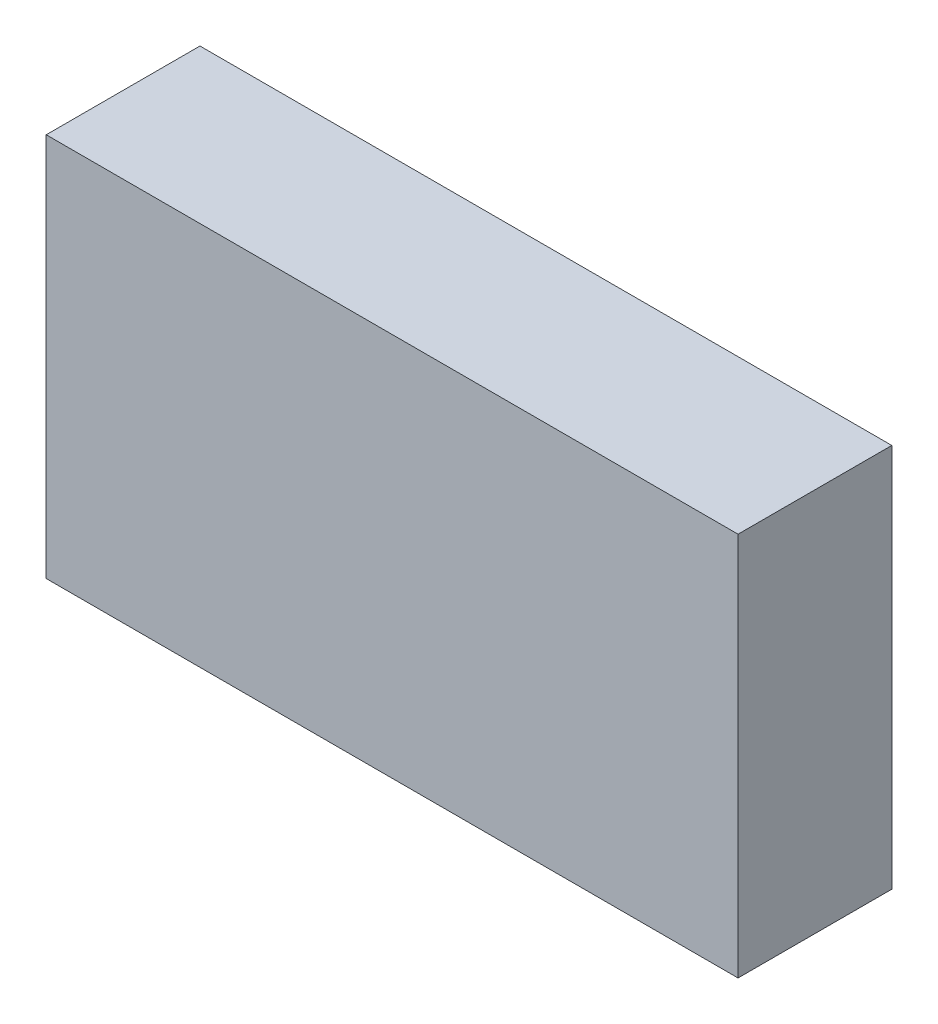
ISO-10303-21;
HEADER;
FILE_DESCRIPTION(('STEP AP214'),'2;1');
FILE_NAME('part.step','',(''),(''),'','','');
FILE_SCHEMA(('AUTOMOTIVE_DESIGN { 1 0 10303 214 1 1 1 1 }'));
ENDSEC;
DATA;
#1=APPLICATION_CONTEXT('core data for automotive mechanical design processes');
#2=APPLICATION_PROTOCOL_DEFINITION('international standard','automotive_design',2000,#1);
#3=PRODUCT_CONTEXT('',#1,'mechanical');
#4=PRODUCT('Part','Part','',(#3));
#5=PRODUCT_RELATED_PRODUCT_CATEGORY('part','',(#4));
#6=PRODUCT_DEFINITION_FORMATION('','',#4);
#7=PRODUCT_DEFINITION_CONTEXT('part definition',#1,'design');
#8=PRODUCT_DEFINITION('design','',#6,#7);
#9=PRODUCT_DEFINITION_SHAPE('','',#8);
#10=(LENGTH_UNIT() NAMED_UNIT(*) SI_UNIT(.MILLI.,.METRE.));
#11=(NAMED_UNIT(*) PLANE_ANGLE_UNIT() SI_UNIT($,.RADIAN.));
#12=(NAMED_UNIT(*) SI_UNIT($,.STERADIAN.) SOLID_ANGLE_UNIT());
#13=UNCERTAINTY_MEASURE_WITH_UNIT(LENGTH_MEASURE(1.E-05),#10,'distance_accuracy_value','');
#14=(GEOMETRIC_REPRESENTATION_CONTEXT(3) GLOBAL_UNCERTAINTY_ASSIGNED_CONTEXT((#13)) GLOBAL_UNIT_ASSIGNED_CONTEXT((#10,
#11,#12)) REPRESENTATION_CONTEXT('',''));
#15=CARTESIAN_POINT('',(0.,0.,0.));
#16=DIRECTION('',(0.,0.,1.));
#17=DIRECTION('',(1.,0.,0.));
#18=AXIS2_PLACEMENT_3D('',#15,#16,#17);
#19=CARTESIAN_POINT('',(1.6,0.375,0.));
#20=DIRECTION('',(1.,0.,0.));
#21=DIRECTION('',(0.,0.,1.));
#22=AXIS2_PLACEMENT_3D('',#19,#20,#21);
#23=PLANE('',#22);
#24=DIRECTION('',(0.,1.,0.));
#25=VECTOR('',#24,1.);
#26=CARTESIAN_POINT('',(1.6,0.375,0.1));
#27=LINE('',#26,#25);
#28=CARTESIAN_POINT('',(1.6,0.375,0.1));
#29=VERTEX_POINT('',#28);
#30=CARTESIAN_POINT('',(1.6,0.625,0.1));
#31=VERTEX_POINT('',#30);
#32=EDGE_CURVE('E11',#29,#31,#27,.T.);
#33=ORIENTED_EDGE('',*,*,#32,.T.);
#34=DIRECTION('',(0.,0.,1.));
#35=VECTOR('',#34,1.);
#36=CARTESIAN_POINT('',(1.6,0.625,0.));
#37=LINE('',#36,#35);
#38=CARTESIAN_POINT('',(1.6,0.625,0.));
#39=VERTEX_POINT('',#38);
#40=EDGE_CURVE('E24',#39,#31,#37,.T.);
#41=ORIENTED_EDGE('',*,*,#40,.F.);
#42=DIRECTION('',(0.,1.,0.));
#43=VECTOR('',#42,1.);
#44=CARTESIAN_POINT('',(1.6,0.375,0.));
#45=LINE('',#44,#43);
#46=CARTESIAN_POINT('',(1.6,0.375,0.));
#47=VERTEX_POINT('',#46);
#48=EDGE_CURVE('E86',#47,#39,#45,.T.);
#49=ORIENTED_EDGE('',*,*,#48,.F.);
#50=DIRECTION('',(0.,0.,1.));
#51=VECTOR('',#50,1.);
#52=CARTESIAN_POINT('',(1.6,0.375,0.));
#53=LINE('',#52,#51);
#54=EDGE_CURVE('E36',#47,#29,#53,.T.);
#55=ORIENTED_EDGE('',*,*,#54,.T.);
#56=EDGE_LOOP('',(#33,#41,#49,#55));
#57=FACE_BOUND('',#56,.T.);
#58=ADVANCED_FACE('F17',(#57),#23,.F.);
#59=CARTESIAN_POINT('',(2.05,0.375,0.));
#60=DIRECTION('',(1.,0.,0.));
#61=DIRECTION('',(0.,0.,1.));
#62=AXIS2_PLACEMENT_3D('',#59,#60,#61);
#63=PLANE('',#62);
#64=DIRECTION('',(0.,0.,1.));
#65=VECTOR('',#64,1.);
#66=CARTESIAN_POINT('',(2.05,0.375,0.));
#67=LINE('',#66,#65);
#68=CARTESIAN_POINT('',(2.05,0.375,0.));
#69=VERTEX_POINT('',#68);
#70=CARTESIAN_POINT('',(2.05,0.375,0.1));
#71=VERTEX_POINT('',#70);
#72=EDGE_CURVE('E83',#69,#71,#67,.T.);
#73=ORIENTED_EDGE('',*,*,#72,.F.);
#74=DIRECTION('',(0.,1.,0.));
#75=VECTOR('',#74,1.);
#76=CARTESIAN_POINT('',(2.05,0.375,0.));
#77=LINE('',#76,#75);
#78=CARTESIAN_POINT('',(2.05,0.625,0.));
#79=VERTEX_POINT('',#78);
#80=EDGE_CURVE('E63',#69,#79,#77,.T.);
#81=ORIENTED_EDGE('',*,*,#80,.T.);
#82=DIRECTION('',(0.,0.,1.));
#83=VECTOR('',#82,1.);
#84=CARTESIAN_POINT('',(2.05,0.625,0.));
#85=LINE('',#84,#83);
#86=CARTESIAN_POINT('',(2.05,0.625,0.1));
#87=VERTEX_POINT('',#86);
#88=EDGE_CURVE('E57',#79,#87,#85,.T.);
#89=ORIENTED_EDGE('',*,*,#88,.T.);
#90=DIRECTION('',(0.,1.,0.));
#91=VECTOR('',#90,1.);
#92=CARTESIAN_POINT('',(2.05,0.375,0.1));
#93=LINE('',#92,#91);
#94=EDGE_CURVE('E60',#71,#87,#93,.T.);
#95=ORIENTED_EDGE('',*,*,#94,.F.);
#96=EDGE_LOOP('',(#73,#81,#89,#95));
#97=FACE_BOUND('',#96,.T.);
#98=ADVANCED_FACE('F59',(#97),#63,.T.);
#99=CARTESIAN_POINT('',(1.6,0.375,0.));
#100=DIRECTION('',(0.,1.,0.));
#101=DIRECTION('',(0.,0.,1.));
#102=AXIS2_PLACEMENT_3D('',#99,#100,#101);
#103=PLANE('',#102);
#104=ORIENTED_EDGE('',*,*,#72,.T.);
#105=DIRECTION('',(1.,0.,0.));
#106=VECTOR('',#105,1.);
#107=CARTESIAN_POINT('',(1.6,0.375,0.1));
#108=LINE('',#107,#106);
#109=EDGE_CURVE('E71',#29,#71,#108,.T.);
#110=ORIENTED_EDGE('',*,*,#109,.F.);
#111=ORIENTED_EDGE('',*,*,#54,.F.);
#112=DIRECTION('',(1.,0.,0.));
#113=VECTOR('',#112,1.);
#114=CARTESIAN_POINT('',(1.6,0.375,0.));
#115=LINE('',#114,#113);
#116=EDGE_CURVE('E76',#47,#69,#115,.T.);
#117=ORIENTED_EDGE('',*,*,#116,.T.);
#118=EDGE_LOOP('',(#104,#110,#111,#117));
#119=FACE_BOUND('',#118,.T.);
#120=ADVANCED_FACE('F91',(#119),#103,.F.);
#121=CARTESIAN_POINT('',(1.6,0.625,0.));
#122=DIRECTION('',(0.,1.,0.));
#123=DIRECTION('',(0.,0.,1.));
#124=AXIS2_PLACEMENT_3D('',#121,#122,#123);
#125=PLANE('',#124);
#126=DIRECTION('',(1.,0.,0.));
#127=VECTOR('',#126,1.);
#128=CARTESIAN_POINT('',(1.6,0.625,0.));
#129=LINE('',#128,#127);
#130=EDGE_CURVE('E74',#39,#79,#129,.T.);
#131=ORIENTED_EDGE('',*,*,#130,.F.);
#132=ORIENTED_EDGE('',*,*,#40,.T.);
#133=DIRECTION('',(1.,0.,0.));
#134=VECTOR('',#133,1.);
#135=CARTESIAN_POINT('',(1.6,0.625,0.1));
#136=LINE('',#135,#134);
#137=EDGE_CURVE('E69',#31,#87,#136,.T.);
#138=ORIENTED_EDGE('',*,*,#137,.T.);
#139=ORIENTED_EDGE('',*,*,#88,.F.);
#140=EDGE_LOOP('',(#131,#132,#138,#139));
#141=FACE_BOUND('',#140,.T.);
#142=ADVANCED_FACE('F73',(#141),#125,.T.);
#143=CARTESIAN_POINT('',(1.6,0.375,0.));
#144=DIRECTION('',(0.,0.,1.));
#145=DIRECTION('',(1.,0.,0.));
#146=AXIS2_PLACEMENT_3D('',#143,#144,#145);
#147=PLANE('',#146);
#148=ORIENTED_EDGE('',*,*,#130,.T.);
#149=ORIENTED_EDGE('',*,*,#80,.F.);
#150=ORIENTED_EDGE('',*,*,#116,.F.);
#151=ORIENTED_EDGE('',*,*,#48,.T.);
#152=EDGE_LOOP('',(#148,#149,#150,#151));
#153=FACE_BOUND('',#152,.T.);
#154=ADVANCED_FACE('F89',(#153),#147,.F.);
#155=CARTESIAN_POINT('',(1.6,0.375,0.1));
#156=DIRECTION('',(0.,0.,1.));
#157=DIRECTION('',(1.,0.,0.));
#158=AXIS2_PLACEMENT_3D('',#155,#156,#157);
#159=PLANE('',#158);
#160=ORIENTED_EDGE('',*,*,#32,.F.);
#161=ORIENTED_EDGE('',*,*,#109,.T.);
#162=ORIENTED_EDGE('',*,*,#94,.T.);
#163=ORIENTED_EDGE('',*,*,#137,.F.);
#164=EDGE_LOOP('',(#160,#161,#162,#163));
#165=FACE_BOUND('',#164,.T.);
#166=ADVANCED_FACE('F68',(#165),#159,.T.);
#167=CLOSED_SHELL('',(#58,#98,#120,#142,#154,#166));
#168=MANIFOLD_SOLID_BREP('B1',#167);
#169=ADVANCED_BREP_SHAPE_REPRESENTATION('',(#18,#168),#14);
#170=SHAPE_DEFINITION_REPRESENTATION(#9,#169);
ENDSEC;
END-ISO-10303-21;
